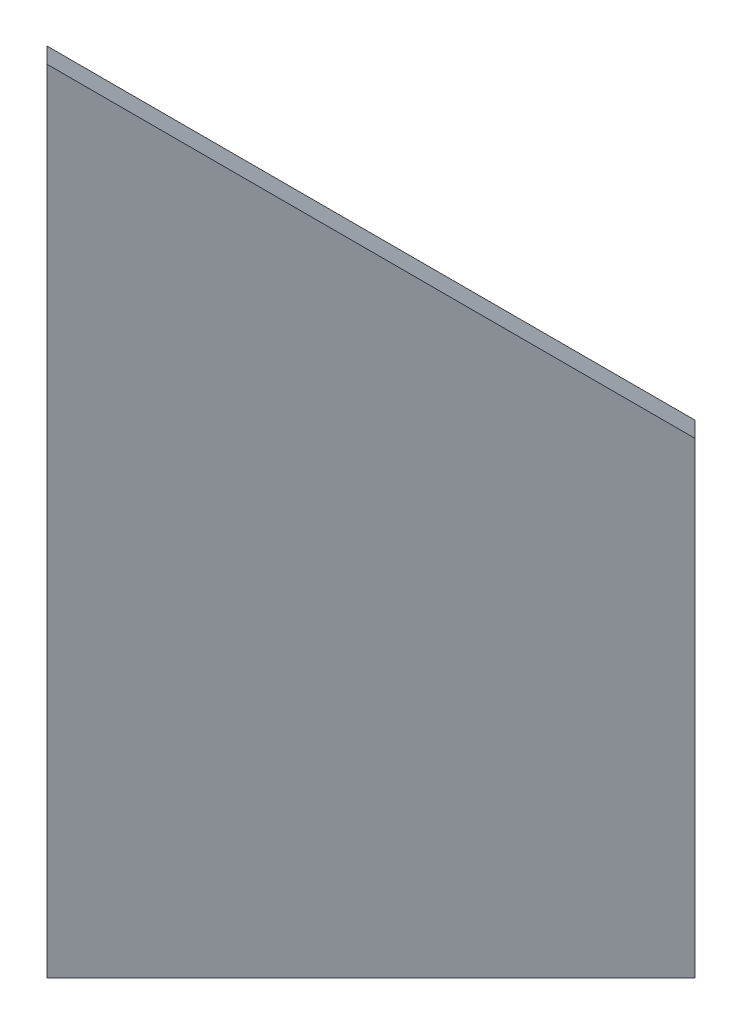
ISO-10303-21;
HEADER;
FILE_DESCRIPTION(('STEP AP214'),'2;1');
FILE_NAME('part.step','',(''),(''),'','','');
FILE_SCHEMA(('AUTOMOTIVE_DESIGN { 1 0 10303 214 1 1 1 1 }'));
ENDSEC;
DATA;
#1=APPLICATION_CONTEXT('core data for automotive mechanical design processes');
#2=APPLICATION_PROTOCOL_DEFINITION('international standard','automotive_design',2000,#1);
#3=PRODUCT_CONTEXT('',#1,'mechanical');
#4=PRODUCT('Part','Part','',(#3));
#5=PRODUCT_RELATED_PRODUCT_CATEGORY('part','',(#4));
#6=PRODUCT_DEFINITION_FORMATION('','',#4);
#7=PRODUCT_DEFINITION_CONTEXT('part definition',#1,'design');
#8=PRODUCT_DEFINITION('design','',#6,#7);
#9=PRODUCT_DEFINITION_SHAPE('','',#8);
#10=(LENGTH_UNIT() NAMED_UNIT(*) SI_UNIT(.MILLI.,.METRE.));
#11=(NAMED_UNIT(*) PLANE_ANGLE_UNIT() SI_UNIT($,.RADIAN.));
#12=(NAMED_UNIT(*) SI_UNIT($,.STERADIAN.) SOLID_ANGLE_UNIT());
#13=UNCERTAINTY_MEASURE_WITH_UNIT(LENGTH_MEASURE(1.E-05),#10,'distance_accuracy_value','');
#14=(GEOMETRIC_REPRESENTATION_CONTEXT(3) GLOBAL_UNCERTAINTY_ASSIGNED_CONTEXT((#13)) GLOBAL_UNIT_ASSIGNED_CONTEXT((#10,
#11,#12)) REPRESENTATION_CONTEXT('',''));
#15=CARTESIAN_POINT('',(0.,0.,0.));
#16=DIRECTION('',(0.,0.,1.));
#17=DIRECTION('',(1.,0.,0.));
#18=AXIS2_PLACEMENT_3D('',#15,#16,#17);
#19=CARTESIAN_POINT('',(46.3627115231441,-111.164878,116.561589395994));
#20=DIRECTION('',(-0.707106781186548,0.,0.707106781186547));
#21=DIRECTION('',(0.707106781186547,0.,0.707106781186548));
#22=AXIS2_PLACEMENT_3D('',#19,#20,#21);
#23=PLANE('',#22);
#24=DIRECTION('',(0.,1.,0.));
#25=VECTOR('',#24,1.);
#26=CARTESIAN_POINT('',(44.2413911795844,-111.164878,114.440269052434));
#27=LINE('',#26,#25);
#28=CARTESIAN_POINT('',(44.2413911795844,-111.164878,114.440269052434));
#29=VERTEX_POINT('',#28);
#30=CARTESIAN_POINT('',(44.2413911795844,-48.412903324699,114.440269052434));
#31=VERTEX_POINT('',#30);
#32=EDGE_CURVE('E106',#29,#31,#27,.T.);
#33=ORIENTED_EDGE('',*,*,#32,.T.);
#34=DIRECTION('',(-0.707106781186547,0.,-0.707106781186548));
#35=VECTOR('',#34,1.);
#36=CARTESIAN_POINT('',(46.3627115231441,-48.412903324699,116.561589395994));
#37=LINE('',#36,#35);
#38=CARTESIAN_POINT('',(46.3627115231441,-48.412903324699,116.561589395994));
#39=VERTEX_POINT('',#38);
#40=EDGE_CURVE('E11',#39,#31,#37,.T.);
#41=ORIENTED_EDGE('',*,*,#40,.F.);
#42=DIRECTION('',(0.,1.,0.));
#43=VECTOR('',#42,1.);
#44=CARTESIAN_POINT('',(46.3627115231441,-111.164878,116.561589395994));
#45=LINE('',#44,#43);
#46=CARTESIAN_POINT('',(46.3627115231441,-111.164878,116.561589395994));
#47=VERTEX_POINT('',#46);
#48=EDGE_CURVE('E93',#47,#39,#45,.T.);
#49=ORIENTED_EDGE('',*,*,#48,.F.);
#50=DIRECTION('',(-0.707106781186547,0.,-0.707106781186548));
#51=VECTOR('',#50,1.);
#52=CARTESIAN_POINT('',(46.3627115231441,-111.164878,116.561589395994));
#53=LINE('',#52,#51);
#54=EDGE_CURVE('E102',#47,#29,#53,.T.);
#55=ORIENTED_EDGE('',*,*,#54,.T.);
#56=EDGE_LOOP('',(#33,#41,#49,#55));
#57=FACE_BOUND('',#56,.T.);
#58=ADVANCED_FACE('F39',(#57),#23,.F.);
#59=CARTESIAN_POINT('',(46.3627115231441,-48.412903324699,116.561589395994));
#60=DIRECTION('',(-0.408248290463864,-0.816496580927725,0.408248290463864));
#61=DIRECTION('',(0.894427190999915,-0.447213595499959,0.));
#62=AXIS2_PLACEMENT_3D('',#59,#60,#61);
#63=PLANE('',#62);
#64=DIRECTION('',(-0.577350269189625,0.577350269189627,0.577350269189625));
#65=VECTOR('',#64,1.);
#66=CARTESIAN_POINT('',(44.2413911795844,-48.412903324699,114.440269052434));
#67=LINE('',#66,#65);
#68=CARTESIAN_POINT('',(0.735391052434014,-4.90690319754847,157.946269179584));
#69=VERTEX_POINT('',#68);
#70=EDGE_CURVE('E98',#31,#69,#67,.T.);
#71=ORIENTED_EDGE('',*,*,#70,.T.);
#72=DIRECTION('',(-0.707106781186547,0.,-0.707106781186548));
#73=VECTOR('',#72,1.);
#74=CARTESIAN_POINT('',(2.85671139599366,-4.90690319754847,160.067589523144));
#75=LINE('',#74,#73);
#76=CARTESIAN_POINT('',(2.85671139599366,-4.90690319754847,160.067589523144));
#77=VERTEX_POINT('',#76);
#78=EDGE_CURVE('E48',#77,#69,#75,.T.);
#79=ORIENTED_EDGE('',*,*,#78,.F.);
#80=DIRECTION('',(-0.577350269189625,0.577350269189627,0.577350269189625));
#81=VECTOR('',#80,1.);
#82=CARTESIAN_POINT('',(46.3627115231441,-48.412903324699,116.561589395994));
#83=LINE('',#82,#81);
#84=EDGE_CURVE('E88',#39,#77,#83,.T.);
#85=ORIENTED_EDGE('',*,*,#84,.F.);
#86=ORIENTED_EDGE('',*,*,#40,.T.);
#87=EDGE_LOOP('',(#71,#79,#85,#86));
#88=FACE_BOUND('',#87,.T.);
#89=ADVANCED_FACE('F97',(#88),#63,.F.);
#90=CARTESIAN_POINT('',(2.85671139599366,-4.90690319754847,160.067589523144));
#91=DIRECTION('',(0.707106781186548,0.,-0.707106781186547));
#92=DIRECTION('',(-0.707106781186547,0.,-0.707106781186548));
#93=AXIS2_PLACEMENT_3D('',#90,#91,#92);
#94=PLANE('',#93);
#95=DIRECTION('',(0.,-1.,0.));
#96=VECTOR('',#95,1.);
#97=CARTESIAN_POINT('',(0.735391052434014,-4.90690319754847,157.946269179584));
#98=LINE('',#97,#96);
#99=CARTESIAN_POINT('',(0.735391052434014,-111.164878,157.946269179584));
#100=VERTEX_POINT('',#99);
#101=EDGE_CURVE('E74',#69,#100,#98,.T.);
#102=ORIENTED_EDGE('',*,*,#101,.T.);
#103=DIRECTION('',(-0.707106781186547,0.,-0.707106781186548));
#104=VECTOR('',#103,1.);
#105=CARTESIAN_POINT('',(2.85671139599366,-111.164878,160.067589523144));
#106=LINE('',#105,#104);
#107=CARTESIAN_POINT('',(2.85671139599366,-111.164878,160.067589523144));
#108=VERTEX_POINT('',#107);
#109=EDGE_CURVE('E99',#108,#100,#106,.T.);
#110=ORIENTED_EDGE('',*,*,#109,.F.);
#111=DIRECTION('',(0.,-1.,0.));
#112=VECTOR('',#111,1.);
#113=CARTESIAN_POINT('',(2.85671139599366,-4.90690319754847,160.067589523144));
#114=LINE('',#113,#112);
#115=EDGE_CURVE('E91',#77,#108,#114,.T.);
#116=ORIENTED_EDGE('',*,*,#115,.F.);
#117=ORIENTED_EDGE('',*,*,#78,.T.);
#118=EDGE_LOOP('',(#102,#110,#116,#117));
#119=FACE_BOUND('',#118,.T.);
#120=ADVANCED_FACE('F100',(#119),#94,.F.);
#121=CARTESIAN_POINT('',(2.85671139599366,-111.164878,160.067589523144));
#122=DIRECTION('',(0.,1.,0.));
#123=DIRECTION('',(0.,0.,1.));
#124=AXIS2_PLACEMENT_3D('',#121,#122,#123);
#125=PLANE('',#124);
#126=DIRECTION('',(0.707106781186548,0.,-0.707106781186548));
#127=VECTOR('',#126,1.);
#128=CARTESIAN_POINT('',(0.735391052434014,-111.164878,157.946269179584));
#129=LINE('',#128,#127);
#130=EDGE_CURVE('E80',#100,#29,#129,.T.);
#131=ORIENTED_EDGE('',*,*,#130,.T.);
#132=ORIENTED_EDGE('',*,*,#54,.F.);
#133=DIRECTION('',(0.707106781186548,0.,-0.707106781186548));
#134=VECTOR('',#133,1.);
#135=CARTESIAN_POINT('',(2.85671139599366,-111.164878,160.067589523144));
#136=LINE('',#135,#134);
#137=EDGE_CURVE('E56',#108,#47,#136,.T.);
#138=ORIENTED_EDGE('',*,*,#137,.F.);
#139=ORIENTED_EDGE('',*,*,#109,.T.);
#140=EDGE_LOOP('',(#131,#132,#138,#139));
#141=FACE_BOUND('',#140,.T.);
#142=ADVANCED_FACE('F115',(#141),#125,.F.);
#143=CARTESIAN_POINT('',(81.4621504595689,0.,81.4621504595689));
#144=DIRECTION('',(-0.707106781186547,0.,-0.707106781186548));
#145=DIRECTION('',(-0.707106781186548,0.,0.707106781186547));
#146=AXIS2_PLACEMENT_3D('',#143,#144,#145);
#147=PLANE('',#146);
#148=ORIENTED_EDGE('',*,*,#48,.T.);
#149=ORIENTED_EDGE('',*,*,#84,.T.);
#150=ORIENTED_EDGE('',*,*,#115,.T.);
#151=ORIENTED_EDGE('',*,*,#137,.T.);
#152=EDGE_LOOP('',(#148,#149,#150,#151));
#153=FACE_BOUND('',#152,.T.);
#154=ADVANCED_FACE('F89',(#153),#147,.F.);
#155=CARTESIAN_POINT('',(79.3408301160092,0.,79.3408301160092));
#156=DIRECTION('',(-0.707106781186547,0.,-0.707106781186548));
#157=DIRECTION('',(-0.707106781186548,0.,0.707106781186547));
#158=AXIS2_PLACEMENT_3D('',#155,#156,#157);
#159=PLANE('',#158);
#160=ORIENTED_EDGE('',*,*,#32,.F.);
#161=ORIENTED_EDGE('',*,*,#130,.F.);
#162=ORIENTED_EDGE('',*,*,#101,.F.);
#163=ORIENTED_EDGE('',*,*,#70,.F.);
#164=EDGE_LOOP('',(#160,#161,#162,#163));
#165=FACE_BOUND('',#164,.T.);
#166=ADVANCED_FACE('F118',(#165),#159,.T.);
#167=CLOSED_SHELL('',(#58,#89,#120,#142,#154,#166));
#168=MANIFOLD_SOLID_BREP('B2',#167);
#169=ADVANCED_BREP_SHAPE_REPRESENTATION('',(#18,#168),#14);
#170=SHAPE_DEFINITION_REPRESENTATION(#9,#169);
ENDSEC;
END-ISO-10303-21;
